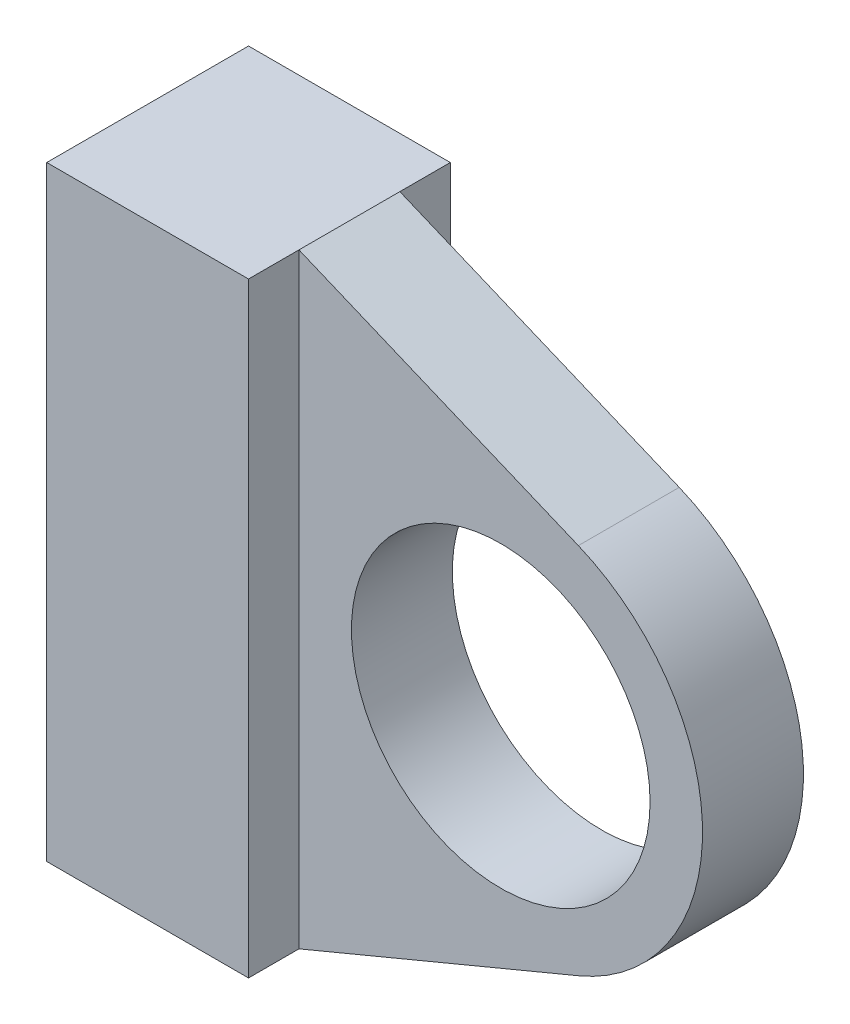
ISO-10303-21;
HEADER;
FILE_DESCRIPTION(('STEP AP214'),'2;1');
FILE_NAME('part.step','',(''),(''),'','','');
FILE_SCHEMA(('AUTOMOTIVE_DESIGN { 1 0 10303 214 1 1 1 1 }'));
ENDSEC;
DATA;
#1=APPLICATION_CONTEXT('core data for automotive mechanical design processes');
#2=APPLICATION_PROTOCOL_DEFINITION('international standard','automotive_design',2000,#1);
#3=PRODUCT_CONTEXT('',#1,'mechanical');
#4=PRODUCT('Part','Part','',(#3));
#5=PRODUCT_RELATED_PRODUCT_CATEGORY('part','',(#4));
#6=PRODUCT_DEFINITION_FORMATION('','',#4);
#7=PRODUCT_DEFINITION_CONTEXT('part definition',#1,'design');
#8=PRODUCT_DEFINITION('design','',#6,#7);
#9=PRODUCT_DEFINITION_SHAPE('','',#8);
#10=(LENGTH_UNIT() NAMED_UNIT(*) SI_UNIT(.MILLI.,.METRE.));
#11=(NAMED_UNIT(*) PLANE_ANGLE_UNIT() SI_UNIT($,.RADIAN.));
#12=(NAMED_UNIT(*) SI_UNIT($,.STERADIAN.) SOLID_ANGLE_UNIT());
#13=UNCERTAINTY_MEASURE_WITH_UNIT(LENGTH_MEASURE(1.E-05),#10,'distance_accuracy_value','');
#14=(GEOMETRIC_REPRESENTATION_CONTEXT(3) GLOBAL_UNCERTAINTY_ASSIGNED_CONTEXT((#13)) GLOBAL_UNIT_ASSIGNED_CONTEXT((#10,
#11,#12)) REPRESENTATION_CONTEXT('',''));
#15=CARTESIAN_POINT('',(0.,0.,0.));
#16=DIRECTION('',(0.,0.,1.));
#17=DIRECTION('',(1.,0.,0.));
#18=AXIS2_PLACEMENT_3D('',#15,#16,#17);
#19=CARTESIAN_POINT('',(-576.027317330751,-1583.60033402962,3.175));
#20=DIRECTION('',(0.,0.,1.));
#21=DIRECTION('',(1.,0.,0.));
#22=AXIS2_PLACEMENT_3D('',#19,#20,#21);
#23=PLANE('',#22);
#24=CARTESIAN_POINT('',(-576.027317330751,-1583.60033402962,3.175));
#25=DIRECTION('',(0.,0.,1.));
#26=DIRECTION('',(1.,0.,0.));
#27=AXIS2_PLACEMENT_3D('',#24,#25,#26);
#28=CIRCLE('',#27,9.39799999999994);
#29=CARTESIAN_POINT('',(-566.629317330751,-1583.60033402962,3.175));
#30=VERTEX_POINT('',#29);
#31=EDGE_CURVE('E107',#30,#30,#28,.T.);
#32=ORIENTED_EDGE('',*,*,#31,.F.);
#33=EDGE_LOOP('',(#32));
#34=FACE_BOUND('',#33,.T.);
#35=DIRECTION('',(-0.923076923076929,0.384615384615371,0.));
#36=VECTOR('',#35,1.);
#37=CARTESIAN_POINT('',(-588.727317330752,-1564.55033402962,3.175));
#38=LINE('',#37,#36);
#39=CARTESIAN_POINT('',(-571.142701946136,-1571.87725710655,3.175));
#40=VERTEX_POINT('',#39);
#41=CARTESIAN_POINT('',(-588.727317330752,-1564.55033402962,3.175));
#42=VERTEX_POINT('',#41);
#43=EDGE_CURVE('E50',#40,#42,#38,.T.);
#44=ORIENTED_EDGE('',*,*,#43,.T.);
#45=DIRECTION('',(0.,-1.,0.));
#46=VECTOR('',#45,1.);
#47=CARTESIAN_POINT('',(-588.727317330752,-1583.60033402962,3.175));
#48=LINE('',#47,#46);
#49=CARTESIAN_POINT('',(-588.727317330752,-1602.65033402962,3.175));
#50=VERTEX_POINT('',#49);
#51=EDGE_CURVE('E86',#42,#50,#48,.T.);
#52=ORIENTED_EDGE('',*,*,#51,.T.);
#53=DIRECTION('',(0.923076923076934,0.384615384615358,0.));
#54=VECTOR('',#53,1.);
#55=CARTESIAN_POINT('',(-588.727317330752,-1602.65033402962,3.175));
#56=LINE('',#55,#54);
#57=CARTESIAN_POINT('',(-571.142701946137,-1595.3234109527,3.175));
#58=VERTEX_POINT('',#57);
#59=EDGE_CURVE('E81',#50,#58,#56,.T.);
#60=ORIENTED_EDGE('',*,*,#59,.T.);
#61=CARTESIAN_POINT('',(-576.027317330751,-1583.60033402962,3.175));
#62=DIRECTION('',(0.,0.,1.));
#63=DIRECTION('',(1.,0.,0.));
#64=AXIS2_PLACEMENT_3D('',#61,#62,#63);
#65=CIRCLE('',#64,12.6999999999999);
#66=EDGE_CURVE('E83',#58,#40,#65,.T.);
#67=ORIENTED_EDGE('',*,*,#66,.T.);
#68=EDGE_LOOP('',(#44,#52,#60,#67));
#69=FACE_BOUND('',#68,.T.);
#70=ADVANCED_FACE('F33',(#34,#69),#23,.T.);
#71=CARTESIAN_POINT('',(-576.027317330751,-1583.60033402962,-3.175));
#72=DIRECTION('',(0.,0.,1.));
#73=DIRECTION('',(1.,0.,0.));
#74=AXIS2_PLACEMENT_3D('',#71,#72,#73);
#75=PLANE('',#74);
#76=CARTESIAN_POINT('',(-576.027317330751,-1583.60033402962,-3.175));
#77=DIRECTION('',(0.,0.,1.));
#78=DIRECTION('',(1.,0.,0.));
#79=AXIS2_PLACEMENT_3D('',#76,#77,#78);
#80=CIRCLE('',#79,9.39799999999994);
#81=CARTESIAN_POINT('',(-566.629317330751,-1583.60033402962,-3.175));
#82=VERTEX_POINT('',#81);
#83=EDGE_CURVE('E164',#82,#82,#80,.T.);
#84=ORIENTED_EDGE('',*,*,#83,.T.);
#85=EDGE_LOOP('',(#84));
#86=FACE_BOUND('',#85,.T.);
#87=DIRECTION('',(0.,-1.,0.));
#88=VECTOR('',#87,1.);
#89=CARTESIAN_POINT('',(-588.727317330752,-1583.60033402962,-3.175));
#90=LINE('',#89,#88);
#91=CARTESIAN_POINT('',(-588.727317330752,-1564.55033402962,-3.175));
#92=VERTEX_POINT('',#91);
#93=CARTESIAN_POINT('',(-588.727317330752,-1602.65033402962,-3.175));
#94=VERTEX_POINT('',#93);
#95=EDGE_CURVE('E73',#92,#94,#90,.T.);
#96=ORIENTED_EDGE('',*,*,#95,.F.);
#97=DIRECTION('',(-0.923076923076929,0.384615384615371,0.));
#98=VECTOR('',#97,1.);
#99=CARTESIAN_POINT('',(-588.727317330752,-1564.55033402962,-3.175));
#100=LINE('',#99,#98);
#101=CARTESIAN_POINT('',(-571.142701946136,-1571.87725710655,-3.175));
#102=VERTEX_POINT('',#101);
#103=EDGE_CURVE('E89',#102,#92,#100,.T.);
#104=ORIENTED_EDGE('',*,*,#103,.F.);
#105=CARTESIAN_POINT('',(-576.027317330751,-1583.60033402962,-3.175));
#106=DIRECTION('',(0.,0.,1.));
#107=DIRECTION('',(1.,0.,0.));
#108=AXIS2_PLACEMENT_3D('',#105,#106,#107);
#109=CIRCLE('',#108,12.6999999999999);
#110=CARTESIAN_POINT('',(-571.142701946137,-1595.3234109527,-3.175));
#111=VERTEX_POINT('',#110);
#112=EDGE_CURVE('E106',#111,#102,#109,.T.);
#113=ORIENTED_EDGE('',*,*,#112,.F.);
#114=DIRECTION('',(0.923076923076934,0.384615384615358,0.));
#115=VECTOR('',#114,1.);
#116=CARTESIAN_POINT('',(-588.727317330752,-1602.65033402962,-3.175));
#117=LINE('',#116,#115);
#118=EDGE_CURVE('E62',#94,#111,#117,.T.);
#119=ORIENTED_EDGE('',*,*,#118,.F.);
#120=EDGE_LOOP('',(#96,#104,#113,#119));
#121=FACE_BOUND('',#120,.T.);
#122=ADVANCED_FACE('F169',(#86,#121),#75,.F.);
#123=CARTESIAN_POINT('',(-601.427317330752,-1564.55033402962,3.175));
#124=DIRECTION('',(0.,-1.,0.));
#125=DIRECTION('',(0.,0.,-1.));
#126=AXIS2_PLACEMENT_3D('',#123,#124,#125);
#127=PLANE('',#126);
#128=DIRECTION('',(0.,0.,-1.));
#129=VECTOR('',#128,1.);
#130=CARTESIAN_POINT('',(-588.727317330752,-1564.55033402962,3.175));
#131=LINE('',#130,#129);
#132=EDGE_CURVE('E101',#42,#92,#131,.T.);
#133=ORIENTED_EDGE('',*,*,#132,.T.);
#134=DIRECTION('',(0.,0.,-1.));
#135=VECTOR('',#134,1.);
#136=CARTESIAN_POINT('',(-588.727317330752,-1564.55033402962,6.35));
#137=LINE('',#136,#135);
#138=CARTESIAN_POINT('',(-588.727317330752,-1564.55033402962,-6.35));
#139=VERTEX_POINT('',#138);
#140=EDGE_CURVE('E159',#92,#139,#137,.T.);
#141=ORIENTED_EDGE('',*,*,#140,.T.);
#142=DIRECTION('',(-1.,0.,0.));
#143=VECTOR('',#142,1.);
#144=CARTESIAN_POINT('',(-601.427317330752,-1564.55033402962,-6.35));
#145=LINE('',#144,#143);
#146=CARTESIAN_POINT('',(-601.427317330752,-1564.55033402962,-6.35));
#147=VERTEX_POINT('',#146);
#148=EDGE_CURVE('E152',#139,#147,#145,.T.);
#149=ORIENTED_EDGE('',*,*,#148,.T.);
#150=DIRECTION('',(0.,0.,-1.));
#151=VECTOR('',#150,1.);
#152=CARTESIAN_POINT('',(-601.427317330752,-1564.55033402962,3.175));
#153=LINE('',#152,#151);
#154=CARTESIAN_POINT('',(-601.427317330752,-1564.55033402962,6.35));
#155=VERTEX_POINT('',#154);
#156=EDGE_CURVE('E11',#155,#147,#153,.T.);
#157=ORIENTED_EDGE('',*,*,#156,.F.);
#158=DIRECTION('',(-1.,0.,0.));
#159=VECTOR('',#158,1.);
#160=CARTESIAN_POINT('',(-601.427317330752,-1564.55033402962,6.35));
#161=LINE('',#160,#159);
#162=CARTESIAN_POINT('',(-588.727317330752,-1564.55033402962,6.35));
#163=VERTEX_POINT('',#162);
#164=EDGE_CURVE('E148',#163,#155,#161,.T.);
#165=ORIENTED_EDGE('',*,*,#164,.F.);
#166=EDGE_CURVE('E155',#163,#42,#137,.T.);
#167=ORIENTED_EDGE('',*,*,#166,.T.);
#168=EDGE_LOOP('',(#133,#141,#149,#157,#165,#167));
#169=FACE_BOUND('',#168,.T.);
#170=ADVANCED_FACE('F35',(#169),#127,.F.);
#171=CARTESIAN_POINT('',(-601.427317330752,-1564.55033402962,3.175));
#172=DIRECTION('',(1.,0.,0.));
#173=DIRECTION('',(0.,0.,-1.));
#174=AXIS2_PLACEMENT_3D('',#171,#172,#173);
#175=PLANE('',#174);
#176=ORIENTED_EDGE('',*,*,#156,.T.);
#177=DIRECTION('',(0.,-1.,0.));
#178=VECTOR('',#177,1.);
#179=CARTESIAN_POINT('',(-601.427317330752,-1564.55033402962,-6.35));
#180=LINE('',#179,#178);
#181=CARTESIAN_POINT('',(-601.427317330752,-1602.65033402962,-6.35));
#182=VERTEX_POINT('',#181);
#183=EDGE_CURVE('E139',#147,#182,#180,.T.);
#184=ORIENTED_EDGE('',*,*,#183,.T.);
#185=DIRECTION('',(0.,0.,-1.));
#186=VECTOR('',#185,1.);
#187=CARTESIAN_POINT('',(-601.427317330752,-1602.65033402962,3.175));
#188=LINE('',#187,#186);
#189=CARTESIAN_POINT('',(-601.427317330752,-1602.65033402962,6.35));
#190=VERTEX_POINT('',#189);
#191=EDGE_CURVE('E42',#190,#182,#188,.T.);
#192=ORIENTED_EDGE('',*,*,#191,.F.);
#193=DIRECTION('',(0.,-1.,0.));
#194=VECTOR('',#193,1.);
#195=CARTESIAN_POINT('',(-601.427317330752,-1564.55033402962,6.35));
#196=LINE('',#195,#194);
#197=EDGE_CURVE('E154',#155,#190,#196,.T.);
#198=ORIENTED_EDGE('',*,*,#197,.F.);
#199=EDGE_LOOP('',(#176,#184,#192,#198));
#200=FACE_BOUND('',#199,.T.);
#201=ADVANCED_FACE('F143',(#200),#175,.F.);
#202=CARTESIAN_POINT('',(-601.427317330752,-1602.65033402962,3.175));
#203=DIRECTION('',(0.,1.,0.));
#204=DIRECTION('',(-1.,0.,0.));
#205=AXIS2_PLACEMENT_3D('',#202,#203,#204);
#206=PLANE('',#205);
#207=ORIENTED_EDGE('',*,*,#191,.T.);
#208=DIRECTION('',(1.,0.,0.));
#209=VECTOR('',#208,1.);
#210=CARTESIAN_POINT('',(-601.427317330752,-1602.65033402962,-6.35));
#211=LINE('',#210,#209);
#212=CARTESIAN_POINT('',(-588.727317330752,-1602.65033402962,-6.35));
#213=VERTEX_POINT('',#212);
#214=EDGE_CURVE('E123',#182,#213,#211,.T.);
#215=ORIENTED_EDGE('',*,*,#214,.T.);
#216=DIRECTION('',(0.,0.,-1.));
#217=VECTOR('',#216,1.);
#218=CARTESIAN_POINT('',(-588.727317330752,-1602.65033402962,6.35));
#219=LINE('',#218,#217);
#220=EDGE_CURVE('E158',#94,#213,#219,.T.);
#221=ORIENTED_EDGE('',*,*,#220,.F.);
#222=DIRECTION('',(0.,0.,-1.));
#223=VECTOR('',#222,1.);
#224=CARTESIAN_POINT('',(-588.727317330752,-1602.65033402962,3.175));
#225=LINE('',#224,#223);
#226=EDGE_CURVE('E95',#50,#94,#225,.T.);
#227=ORIENTED_EDGE('',*,*,#226,.F.);
#228=CARTESIAN_POINT('',(-588.727317330752,-1602.65033402962,6.35));
#229=VERTEX_POINT('',#228);
#230=EDGE_CURVE('E160',#229,#50,#219,.T.);
#231=ORIENTED_EDGE('',*,*,#230,.F.);
#232=DIRECTION('',(1.,0.,0.));
#233=VECTOR('',#232,1.);
#234=CARTESIAN_POINT('',(-601.427317330752,-1602.65033402962,6.35));
#235=LINE('',#234,#233);
#236=EDGE_CURVE('E128',#190,#229,#235,.T.);
#237=ORIENTED_EDGE('',*,*,#236,.F.);
#238=EDGE_LOOP('',(#207,#215,#221,#227,#231,#237));
#239=FACE_BOUND('',#238,.T.);
#240=ADVANCED_FACE('F121',(#239),#206,.F.);
#241=CARTESIAN_POINT('',(-588.727317330752,-1602.65033402962,3.175));
#242=DIRECTION('',(-0.384615384615358,0.923076923076934,0.));
#243=DIRECTION('',(-0.923076923076934,-0.384615384615358,0.));
#244=AXIS2_PLACEMENT_3D('',#241,#242,#243);
#245=PLANE('',#244);
#246=ORIENTED_EDGE('',*,*,#118,.T.);
#247=DIRECTION('',(0.,0.,-1.));
#248=VECTOR('',#247,1.);
#249=CARTESIAN_POINT('',(-571.142701946137,-1595.3234109527,3.175));
#250=LINE('',#249,#248);
#251=EDGE_CURVE('E91',#58,#111,#250,.T.);
#252=ORIENTED_EDGE('',*,*,#251,.F.);
#253=ORIENTED_EDGE('',*,*,#59,.F.);
#254=ORIENTED_EDGE('',*,*,#226,.T.);
#255=EDGE_LOOP('',(#246,#252,#253,#254));
#256=FACE_BOUND('',#255,.T.);
#257=ADVANCED_FACE('F92',(#256),#245,.F.);
#258=CARTESIAN_POINT('',(-576.027317330751,-1583.60033402962,3.175));
#259=DIRECTION('',(0.,0.,-1.));
#260=DIRECTION('',(-1.,0.,0.));
#261=AXIS2_PLACEMENT_3D('',#258,#259,#260);
#262=CYLINDRICAL_SURFACE('',#261,12.6999999999999);
#263=ORIENTED_EDGE('',*,*,#112,.T.);
#264=DIRECTION('',(0.,0.,-1.));
#265=VECTOR('',#264,1.);
#266=CARTESIAN_POINT('',(-571.142701946136,-1571.87725710655,3.175));
#267=LINE('',#266,#265);
#268=EDGE_CURVE('E96',#40,#102,#267,.T.);
#269=ORIENTED_EDGE('',*,*,#268,.F.);
#270=ORIENTED_EDGE('',*,*,#66,.F.);
#271=ORIENTED_EDGE('',*,*,#251,.T.);
#272=EDGE_LOOP('',(#263,#269,#270,#271));
#273=FACE_BOUND('',#272,.T.);
#274=ADVANCED_FACE('F98',(#273),#262,.T.);
#275=CARTESIAN_POINT('',(-588.727317330752,-1564.55033402962,3.175));
#276=DIRECTION('',(-0.384615384615371,-0.923076923076929,0.));
#277=DIRECTION('',(0.923076923076929,-0.384615384615371,0.));
#278=AXIS2_PLACEMENT_3D('',#275,#276,#277);
#279=PLANE('',#278);
#280=ORIENTED_EDGE('',*,*,#103,.T.);
#281=ORIENTED_EDGE('',*,*,#132,.F.);
#282=ORIENTED_EDGE('',*,*,#43,.F.);
#283=ORIENTED_EDGE('',*,*,#268,.T.);
#284=EDGE_LOOP('',(#280,#281,#282,#283));
#285=FACE_BOUND('',#284,.T.);
#286=ADVANCED_FACE('F174',(#285),#279,.F.);
#287=CARTESIAN_POINT('',(-576.027317330751,-1583.60033402962,3.175));
#288=DIRECTION('',(0.,0.,-1.));
#289=DIRECTION('',(-1.,0.,0.));
#290=AXIS2_PLACEMENT_3D('',#287,#288,#289);
#291=CYLINDRICAL_SURFACE('',#290,9.39799999999994);
#292=ORIENTED_EDGE('',*,*,#31,.T.);
#293=EDGE_LOOP('',(#292));
#294=FACE_BOUND('',#293,.T.);
#295=ORIENTED_EDGE('',*,*,#83,.F.);
#296=EDGE_LOOP('',(#295));
#297=FACE_BOUND('',#296,.T.);
#298=ADVANCED_FACE('F172',(#294,#297),#291,.F.);
#299=CARTESIAN_POINT('',(0.,0.,-6.35));
#300=DIRECTION('',(0.,0.,1.));
#301=DIRECTION('',(1.,0.,0.));
#302=AXIS2_PLACEMENT_3D('',#299,#300,#301);
#303=PLANE('',#302);
#304=ORIENTED_EDGE('',*,*,#183,.F.);
#305=ORIENTED_EDGE('',*,*,#148,.F.);
#306=DIRECTION('',(0.,1.,0.));
#307=VECTOR('',#306,1.);
#308=CARTESIAN_POINT('',(-588.727317330752,-1564.55033402962,-6.35));
#309=LINE('',#308,#307);
#310=EDGE_CURVE('E141',#213,#139,#309,.T.);
#311=ORIENTED_EDGE('',*,*,#310,.F.);
#312=ORIENTED_EDGE('',*,*,#214,.F.);
#313=EDGE_LOOP('',(#304,#305,#311,#312));
#314=FACE_BOUND('',#313,.T.);
#315=ADVANCED_FACE('F136',(#314),#303,.F.);
#316=CARTESIAN_POINT('',(-588.727317330752,-1564.55033402962,6.35));
#317=DIRECTION('',(-1.,0.,0.));
#318=DIRECTION('',(0.,0.,1.));
#319=AXIS2_PLACEMENT_3D('',#316,#317,#318);
#320=PLANE('',#319);
#321=ORIENTED_EDGE('',*,*,#140,.F.);
#322=ORIENTED_EDGE('',*,*,#95,.T.);
#323=ORIENTED_EDGE('',*,*,#220,.T.);
#324=ORIENTED_EDGE('',*,*,#310,.T.);
#325=EDGE_LOOP('',(#321,#322,#323,#324));
#326=FACE_BOUND('',#325,.T.);
#327=ADVANCED_FACE('F181',(#326),#320,.F.);
#328=ORIENTED_EDGE('',*,*,#51,.F.);
#329=ORIENTED_EDGE('',*,*,#166,.F.);
#330=DIRECTION('',(0.,1.,0.));
#331=VECTOR('',#330,1.);
#332=CARTESIAN_POINT('',(-588.727317330752,-1564.55033402962,6.35));
#333=LINE('',#332,#331);
#334=EDGE_CURVE('E218',#229,#163,#333,.T.);
#335=ORIENTED_EDGE('',*,*,#334,.F.);
#336=ORIENTED_EDGE('',*,*,#230,.T.);
#337=EDGE_LOOP('',(#328,#329,#335,#336));
#338=FACE_BOUND('',#337,.T.);
#339=ADVANCED_FACE('F213',(#338),#320,.F.);
#340=CARTESIAN_POINT('',(0.,0.,6.35));
#341=DIRECTION('',(0.,0.,1.));
#342=DIRECTION('',(1.,0.,0.));
#343=AXIS2_PLACEMENT_3D('',#340,#341,#342);
#344=PLANE('',#343);
#345=ORIENTED_EDGE('',*,*,#197,.T.);
#346=ORIENTED_EDGE('',*,*,#236,.T.);
#347=ORIENTED_EDGE('',*,*,#334,.T.);
#348=ORIENTED_EDGE('',*,*,#164,.T.);
#349=EDGE_LOOP('',(#345,#346,#347,#348));
#350=FACE_BOUND('',#349,.T.);
#351=ADVANCED_FACE('F227',(#350),#344,.T.);
#352=CLOSED_SHELL('',(#70,#122,#170,#201,#240,#257,#274,#286,#298,#315,#327,#339,#351));
#353=MANIFOLD_SOLID_BREP('B2',#352);
#354=ADVANCED_BREP_SHAPE_REPRESENTATION('',(#18,#353),#14);
#355=SHAPE_DEFINITION_REPRESENTATION(#9,#354);
ENDSEC;
END-ISO-10303-21;
